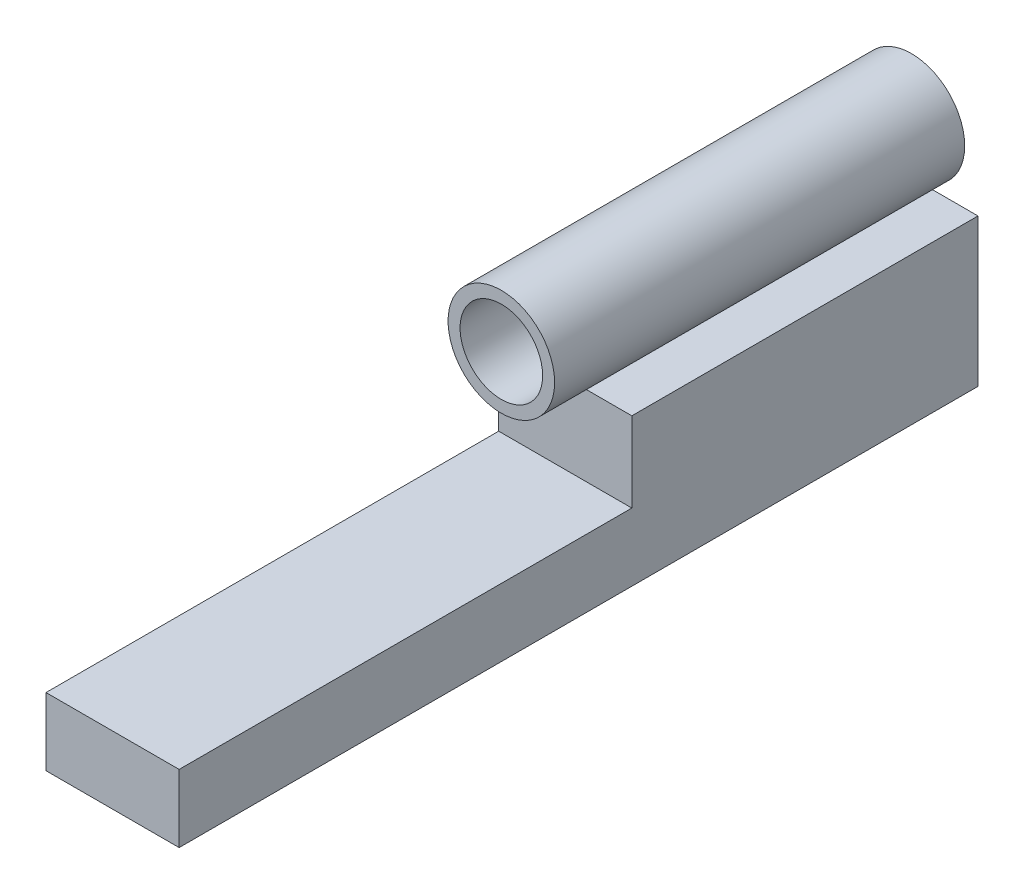
ISO-10303-21;
HEADER;
FILE_DESCRIPTION(('STEP AP214'),'2;1');
FILE_NAME('part.step','',(''),(''),'','','');
FILE_SCHEMA(('AUTOMOTIVE_DESIGN { 1 0 10303 214 1 1 1 1 }'));
ENDSEC;
DATA;
#1=APPLICATION_CONTEXT('core data for automotive mechanical design processes');
#2=APPLICATION_PROTOCOL_DEFINITION('international standard','automotive_design',2000,#1);
#3=PRODUCT_CONTEXT('',#1,'mechanical');
#4=PRODUCT('Part','Part','',(#3));
#5=PRODUCT_RELATED_PRODUCT_CATEGORY('part','',(#4));
#6=PRODUCT_DEFINITION_FORMATION('','',#4);
#7=PRODUCT_DEFINITION_CONTEXT('part definition',#1,'design');
#8=PRODUCT_DEFINITION('design','',#6,#7);
#9=PRODUCT_DEFINITION_SHAPE('','',#8);
#10=(LENGTH_UNIT() NAMED_UNIT(*) SI_UNIT(.MILLI.,.METRE.));
#11=(NAMED_UNIT(*) PLANE_ANGLE_UNIT() SI_UNIT($,.RADIAN.));
#12=(NAMED_UNIT(*) SI_UNIT($,.STERADIAN.) SOLID_ANGLE_UNIT());
#13=UNCERTAINTY_MEASURE_WITH_UNIT(LENGTH_MEASURE(1.E-05),#10,'distance_accuracy_value','');
#14=(GEOMETRIC_REPRESENTATION_CONTEXT(3) GLOBAL_UNCERTAINTY_ASSIGNED_CONTEXT((#13)) GLOBAL_UNIT_ASSIGNED_CONTEXT((#10,
#11,#12)) REPRESENTATION_CONTEXT('',''));
#15=CARTESIAN_POINT('',(0.,0.,0.));
#16=DIRECTION('',(0.,0.,1.));
#17=DIRECTION('',(1.,0.,0.));
#18=AXIS2_PLACEMENT_3D('',#15,#16,#17);
#19=CARTESIAN_POINT('',(12.5,0.,65.));
#20=DIRECTION('',(1.,0.,0.));
#21=DIRECTION('',(0.,1.,0.));
#22=AXIS2_PLACEMENT_3D('',#19,#20,#21);
#23=PLANE('',#22);
#24=DIRECTION('',(0.,-1.,0.));
#25=VECTOR('',#24,1.);
#26=CARTESIAN_POINT('',(12.5,0.,0.));
#27=LINE('',#26,#25);
#28=CARTESIAN_POINT('',(12.5,0.,0.));
#29=VERTEX_POINT('',#28);
#30=CARTESIAN_POINT('',(12.5,-27.7165397130867,0.));
#31=VERTEX_POINT('',#30);
#32=EDGE_CURVE('E94',#29,#31,#27,.T.);
#33=ORIENTED_EDGE('',*,*,#32,.F.);
#34=DIRECTION('',(0.,0.,-1.));
#35=VECTOR('',#34,1.);
#36=CARTESIAN_POINT('',(12.5,0.,65.));
#37=LINE('',#36,#35);
#38=CARTESIAN_POINT('',(12.5,0.,65.));
#39=VERTEX_POINT('',#38);
#40=EDGE_CURVE('E12',#39,#29,#37,.T.);
#41=ORIENTED_EDGE('',*,*,#40,.F.);
#42=DIRECTION('',(0.,-1.,0.));
#43=VECTOR('',#42,1.);
#44=CARTESIAN_POINT('',(12.5,0.,65.));
#45=LINE('',#44,#43);
#46=CARTESIAN_POINT('',(12.5,-15.,65.));
#47=VERTEX_POINT('',#46);
#48=EDGE_CURVE('E91',#39,#47,#45,.T.);
#49=ORIENTED_EDGE('',*,*,#48,.T.);
#50=DIRECTION('',(0.,0.,-1.));
#51=VECTOR('',#50,1.);
#52=CARTESIAN_POINT('',(12.5,-15.,150.));
#53=LINE('',#52,#51);
#54=CARTESIAN_POINT('',(12.5,-15.,150.));
#55=VERTEX_POINT('',#54);
#56=EDGE_CURVE('E63',#55,#47,#53,.T.);
#57=ORIENTED_EDGE('',*,*,#56,.F.);
#58=DIRECTION('',(0.,-1.,0.));
#59=VECTOR('',#58,1.);
#60=CARTESIAN_POINT('',(12.5,0.,150.));
#61=LINE('',#60,#59);
#62=CARTESIAN_POINT('',(12.5,-27.7165397130867,150.));
#63=VERTEX_POINT('',#62);
#64=EDGE_CURVE('E140',#55,#63,#61,.T.);
#65=ORIENTED_EDGE('',*,*,#64,.T.);
#66=DIRECTION('',(0.,0.,-1.));
#67=VECTOR('',#66,1.);
#68=CARTESIAN_POINT('',(12.5,-27.7165397130867,150.));
#69=LINE('',#68,#67);
#70=EDGE_CURVE('E129',#63,#31,#69,.T.);
#71=ORIENTED_EDGE('',*,*,#70,.T.);
#72=EDGE_LOOP('',(#33,#41,#49,#57,#65,#71));
#73=FACE_BOUND('',#72,.T.);
#74=ADVANCED_FACE('F45',(#73),#23,.T.);
#75=CARTESIAN_POINT('',(0.,0.,65.));
#76=DIRECTION('',(0.,1.,0.));
#77=DIRECTION('',(0.,0.,1.));
#78=AXIS2_PLACEMENT_3D('',#75,#76,#77);
#79=PLANE('',#78);
#80=DIRECTION('',(1.,0.,0.));
#81=VECTOR('',#80,1.);
#82=CARTESIAN_POINT('',(0.,0.,0.));
#83=LINE('',#82,#81);
#84=CARTESIAN_POINT('',(-12.5,0.,0.));
#85=VERTEX_POINT('',#84);
#86=EDGE_CURVE('E120',#85,#29,#83,.T.);
#87=ORIENTED_EDGE('',*,*,#86,.F.);
#88=DIRECTION('',(0.,0.,-1.));
#89=VECTOR('',#88,1.);
#90=CARTESIAN_POINT('',(-12.5,0.,65.));
#91=LINE('',#90,#89);
#92=CARTESIAN_POINT('',(-12.5,0.,65.));
#93=VERTEX_POINT('',#92);
#94=EDGE_CURVE('E54',#93,#85,#91,.T.);
#95=ORIENTED_EDGE('',*,*,#94,.F.);
#96=DIRECTION('',(1.,0.,0.));
#97=VECTOR('',#96,1.);
#98=CARTESIAN_POINT('',(0.,0.,65.));
#99=LINE('',#98,#97);
#100=EDGE_CURVE('E100',#93,#39,#99,.T.);
#101=ORIENTED_EDGE('',*,*,#100,.T.);
#102=ORIENTED_EDGE('',*,*,#40,.T.);
#103=EDGE_LOOP('',(#87,#95,#101,#102));
#104=FACE_BOUND('',#103,.T.);
#105=ADVANCED_FACE('F103',(#104),#79,.T.);
#106=CARTESIAN_POINT('',(-12.5,0.,65.));
#107=DIRECTION('',(1.,0.,0.));
#108=DIRECTION('',(0.,1.,0.));
#109=AXIS2_PLACEMENT_3D('',#106,#107,#108);
#110=PLANE('',#109);
#111=DIRECTION('',(0.,-1.,0.));
#112=VECTOR('',#111,1.);
#113=CARTESIAN_POINT('',(-12.5,0.,0.));
#114=LINE('',#113,#112);
#115=CARTESIAN_POINT('',(-12.5,-27.7165397130867,0.));
#116=VERTEX_POINT('',#115);
#117=EDGE_CURVE('E101',#85,#116,#114,.T.);
#118=ORIENTED_EDGE('',*,*,#117,.T.);
#119=DIRECTION('',(0.,0.,-1.));
#120=VECTOR('',#119,1.);
#121=CARTESIAN_POINT('',(-12.5,-27.7165397130867,150.));
#122=LINE('',#121,#120);
#123=CARTESIAN_POINT('',(-12.5,-27.7165397130867,150.));
#124=VERTEX_POINT('',#123);
#125=EDGE_CURVE('E125',#124,#116,#122,.T.);
#126=ORIENTED_EDGE('',*,*,#125,.F.);
#127=DIRECTION('',(0.,-1.,0.));
#128=VECTOR('',#127,1.);
#129=CARTESIAN_POINT('',(-12.5,0.,150.));
#130=LINE('',#129,#128);
#131=CARTESIAN_POINT('',(-12.5,-15.,150.));
#132=VERTEX_POINT('',#131);
#133=EDGE_CURVE('E142',#132,#124,#130,.T.);
#134=ORIENTED_EDGE('',*,*,#133,.F.);
#135=DIRECTION('',(0.,0.,-1.));
#136=VECTOR('',#135,1.);
#137=CARTESIAN_POINT('',(-12.5,-15.,150.));
#138=LINE('',#137,#136);
#139=CARTESIAN_POINT('',(-12.5,-15.,65.));
#140=VERTEX_POINT('',#139);
#141=EDGE_CURVE('E124',#132,#140,#138,.T.);
#142=ORIENTED_EDGE('',*,*,#141,.T.);
#143=DIRECTION('',(0.,-1.,0.));
#144=VECTOR('',#143,1.);
#145=CARTESIAN_POINT('',(-12.5,0.,65.));
#146=LINE('',#145,#144);
#147=EDGE_CURVE('E105',#93,#140,#146,.T.);
#148=ORIENTED_EDGE('',*,*,#147,.F.);
#149=ORIENTED_EDGE('',*,*,#94,.T.);
#150=EDGE_LOOP('',(#118,#126,#134,#142,#148,#149));
#151=FACE_BOUND('',#150,.T.);
#152=ADVANCED_FACE('F160',(#151),#110,.F.);
#153=CARTESIAN_POINT('',(0.,0.,65.));
#154=DIRECTION('',(0.,0.,1.));
#155=DIRECTION('',(1.,0.,0.));
#156=AXIS2_PLACEMENT_3D('',#153,#154,#155);
#157=PLANE('',#156);
#158=ORIENTED_EDGE('',*,*,#48,.F.);
#159=ORIENTED_EDGE('',*,*,#100,.F.);
#160=ORIENTED_EDGE('',*,*,#147,.T.);
#161=DIRECTION('',(1.,0.,0.));
#162=VECTOR('',#161,1.);
#163=CARTESIAN_POINT('',(0.,-15.,65.));
#164=LINE('',#163,#162);
#165=EDGE_CURVE('E80',#140,#47,#164,.T.);
#166=ORIENTED_EDGE('',*,*,#165,.T.);
#167=EDGE_LOOP('',(#158,#159,#160,#166));
#168=FACE_BOUND('',#167,.T.);
#169=ADVANCED_FACE('F98',(#168),#157,.T.);
#170=CARTESIAN_POINT('',(0.,0.,0.));
#171=DIRECTION('',(0.,0.,1.));
#172=DIRECTION('',(1.,0.,0.));
#173=AXIS2_PLACEMENT_3D('',#170,#171,#172);
#174=PLANE('',#173);
#175=ORIENTED_EDGE('',*,*,#32,.T.);
#176=DIRECTION('',(1.,0.,0.));
#177=VECTOR('',#176,1.);
#178=CARTESIAN_POINT('',(0.,-27.7165397130867,0.));
#179=LINE('',#178,#177);
#180=EDGE_CURVE('E137',#116,#31,#179,.T.);
#181=ORIENTED_EDGE('',*,*,#180,.F.);
#182=ORIENTED_EDGE('',*,*,#117,.F.);
#183=ORIENTED_EDGE('',*,*,#86,.T.);
#184=EDGE_LOOP('',(#175,#181,#182,#183));
#185=FACE_BOUND('',#184,.T.);
#186=ADVANCED_FACE('F165',(#185),#174,.F.);
#187=CARTESIAN_POINT('',(0.,-15.,150.));
#188=DIRECTION('',(0.,1.,0.));
#189=DIRECTION('',(-1.,0.,0.));
#190=AXIS2_PLACEMENT_3D('',#187,#188,#189);
#191=PLANE('',#190);
#192=ORIENTED_EDGE('',*,*,#165,.F.);
#193=ORIENTED_EDGE('',*,*,#141,.F.);
#194=DIRECTION('',(1.,0.,0.));
#195=VECTOR('',#194,1.);
#196=CARTESIAN_POINT('',(0.,-15.,150.));
#197=LINE('',#196,#195);
#198=EDGE_CURVE('E145',#132,#55,#197,.T.);
#199=ORIENTED_EDGE('',*,*,#198,.T.);
#200=ORIENTED_EDGE('',*,*,#56,.T.);
#201=EDGE_LOOP('',(#192,#193,#199,#200));
#202=FACE_BOUND('',#201,.T.);
#203=ADVANCED_FACE('F157',(#202),#191,.T.);
#204=CARTESIAN_POINT('',(0.,-27.7165397130867,150.));
#205=DIRECTION('',(0.,1.,0.));
#206=DIRECTION('',(0.,0.,1.));
#207=AXIS2_PLACEMENT_3D('',#204,#205,#206);
#208=PLANE('',#207);
#209=ORIENTED_EDGE('',*,*,#180,.T.);
#210=ORIENTED_EDGE('',*,*,#70,.F.);
#211=DIRECTION('',(1.,0.,0.));
#212=VECTOR('',#211,1.);
#213=CARTESIAN_POINT('',(0.,-27.7165397130867,150.));
#214=LINE('',#213,#212);
#215=EDGE_CURVE('E136',#124,#63,#214,.T.);
#216=ORIENTED_EDGE('',*,*,#215,.F.);
#217=ORIENTED_EDGE('',*,*,#125,.T.);
#218=EDGE_LOOP('',(#209,#210,#216,#217));
#219=FACE_BOUND('',#218,.T.);
#220=ADVANCED_FACE('F164',(#219),#208,.F.);
#221=CARTESIAN_POINT('',(0.,0.,150.));
#222=DIRECTION('',(0.,0.,1.));
#223=DIRECTION('',(1.,0.,0.));
#224=AXIS2_PLACEMENT_3D('',#221,#222,#223);
#225=PLANE('',#224);
#226=ORIENTED_EDGE('',*,*,#64,.F.);
#227=ORIENTED_EDGE('',*,*,#198,.F.);
#228=ORIENTED_EDGE('',*,*,#133,.T.);
#229=ORIENTED_EDGE('',*,*,#215,.T.);
#230=EDGE_LOOP('',(#226,#227,#228,#229));
#231=FACE_BOUND('',#230,.T.);
#232=ADVANCED_FACE('F153',(#231),#225,.T.);
#233=CLOSED_SHELL('',(#74,#105,#152,#169,#186,#203,#220,#232));
#234=MANIFOLD_SOLID_BREP('B2',#233);
#235=CARTESIAN_POINT('',(0.,10.1604272763685,2.5));
#236=DIRECTION('',(0.,0.,-1.));
#237=DIRECTION('',(-1.,0.,0.));
#238=AXIS2_PLACEMENT_3D('',#235,#236,#237);
#239=CYLINDRICAL_SURFACE('',#238,2.5);
#240=CARTESIAN_POINT('',(0.,10.1604272763685,2.5));
#241=DIRECTION('',(0.,0.,1.));
#242=DIRECTION('',(1.,0.,0.));
#243=AXIS2_PLACEMENT_3D('',#240,#241,#242);
#244=CIRCLE('',#243,2.5);
#245=CARTESIAN_POINT('',(2.5,10.1604272763685,2.5));
#246=VERTEX_POINT('',#245);
#247=EDGE_CURVE('E44',#246,#246,#244,.T.);
#248=ORIENTED_EDGE('',*,*,#247,.T.);
#249=EDGE_LOOP('',(#248));
#250=FACE_BOUND('',#249,.T.);
#251=CARTESIAN_POINT('',(0.,10.1604272763685,0.));
#252=DIRECTION('',(0.,0.,1.));
#253=DIRECTION('',(1.,0.,0.));
#254=AXIS2_PLACEMENT_3D('',#251,#252,#253);
#255=CIRCLE('',#254,2.5);
#256=CARTESIAN_POINT('',(2.5,10.1604272763685,0.));
#257=VERTEX_POINT('',#256);
#258=EDGE_CURVE('E246',#257,#257,#255,.T.);
#259=ORIENTED_EDGE('',*,*,#258,.F.);
#260=EDGE_LOOP('',(#259));
#261=FACE_BOUND('',#260,.T.);
#262=ADVANCED_FACE('F243',(#250,#261),#239,.F.);
#263=CARTESIAN_POINT('',(0.,0.,2.5));
#264=DIRECTION('',(0.,0.,1.));
#265=DIRECTION('',(1.,0.,0.));
#266=AXIS2_PLACEMENT_3D('',#263,#264,#265);
#267=PLANE('',#266);
#268=ORIENTED_EDGE('',*,*,#247,.F.);
#269=EDGE_LOOP('',(#268));
#270=FACE_BOUND('',#269,.T.);
#271=CARTESIAN_POINT('',(0.,10.1604272763685,2.5));
#272=DIRECTION('',(0.,0.,1.));
#273=DIRECTION('',(1.,0.,0.));
#274=AXIS2_PLACEMENT_3D('',#271,#272,#273);
#275=CIRCLE('',#274,7.75);
#276=CARTESIAN_POINT('',(7.75,10.1604272763685,2.5));
#277=VERTEX_POINT('',#276);
#278=EDGE_CURVE('E253',#277,#277,#275,.F.);
#279=ORIENTED_EDGE('',*,*,#278,.F.);
#280=EDGE_LOOP('',(#279));
#281=FACE_BOUND('',#280,.T.);
#282=ADVANCED_FACE('F283',(#270,#281),#267,.T.);
#283=CARTESIAN_POINT('',(0.,0.,0.));
#284=DIRECTION('',(0.,0.,1.));
#285=DIRECTION('',(1.,0.,0.));
#286=AXIS2_PLACEMENT_3D('',#283,#284,#285);
#287=PLANE('',#286);
#288=ORIENTED_EDGE('',*,*,#258,.T.);
#289=EDGE_LOOP('',(#288));
#290=FACE_BOUND('',#289,.T.);
#291=CARTESIAN_POINT('',(0.,10.1604272763685,0.));
#292=DIRECTION('',(0.,0.,1.));
#293=DIRECTION('',(1.,0.,0.));
#294=AXIS2_PLACEMENT_3D('',#291,#292,#293);
#295=CIRCLE('',#294,10.);
#296=CARTESIAN_POINT('',(10.,10.1604272763685,0.));
#297=VERTEX_POINT('',#296);
#298=EDGE_CURVE('E258',#297,#297,#295,.T.);
#299=ORIENTED_EDGE('',*,*,#298,.F.);
#300=EDGE_LOOP('',(#299));
#301=FACE_BOUND('',#300,.T.);
#302=ADVANCED_FACE('F281',(#290,#301),#287,.F.);
#303=CARTESIAN_POINT('',(0.,10.1604272763685,77.));
#304=DIRECTION('',(0.,0.,-1.));
#305=DIRECTION('',(-1.,0.,0.));
#306=AXIS2_PLACEMENT_3D('',#303,#304,#305);
#307=CYLINDRICAL_SURFACE('',#306,7.75);
#308=ORIENTED_EDGE('',*,*,#278,.T.);
#309=EDGE_LOOP('',(#308));
#310=FACE_BOUND('',#309,.T.);
#311=CARTESIAN_POINT('',(0.,10.1604272763685,77.));
#312=DIRECTION('',(0.,0.,1.));
#313=DIRECTION('',(1.,0.,0.));
#314=AXIS2_PLACEMENT_3D('',#311,#312,#313);
#315=CIRCLE('',#314,7.75);
#316=CARTESIAN_POINT('',(7.75,10.1604272763685,77.));
#317=VERTEX_POINT('',#316);
#318=EDGE_CURVE('E261',#317,#317,#315,.T.);
#319=ORIENTED_EDGE('',*,*,#318,.T.);
#320=EDGE_LOOP('',(#319));
#321=FACE_BOUND('',#320,.T.);
#322=ADVANCED_FACE('F267',(#310,#321),#307,.F.);
#323=CARTESIAN_POINT('',(0.,10.1604272763685,77.));
#324=DIRECTION('',(0.,0.,-1.));
#325=DIRECTION('',(-1.,0.,0.));
#326=AXIS2_PLACEMENT_3D('',#323,#324,#325);
#327=CYLINDRICAL_SURFACE('',#326,10.);
#328=CARTESIAN_POINT('',(0.,10.1604272763685,77.));
#329=DIRECTION('',(0.,0.,1.));
#330=DIRECTION('',(1.,0.,0.));
#331=AXIS2_PLACEMENT_3D('',#328,#329,#330);
#332=CIRCLE('',#331,10.);
#333=CARTESIAN_POINT('',(10.,10.1604272763685,77.));
#334=VERTEX_POINT('',#333);
#335=EDGE_CURVE('E257',#334,#334,#332,.T.);
#336=ORIENTED_EDGE('',*,*,#335,.F.);
#337=EDGE_LOOP('',(#336));
#338=FACE_BOUND('',#337,.T.);
#339=ORIENTED_EDGE('',*,*,#298,.T.);
#340=EDGE_LOOP('',(#339));
#341=FACE_BOUND('',#340,.T.);
#342=ADVANCED_FACE('F272',(#338,#341),#327,.T.);
#343=CARTESIAN_POINT('',(0.,0.,77.));
#344=DIRECTION('',(0.,0.,1.));
#345=DIRECTION('',(1.,0.,0.));
#346=AXIS2_PLACEMENT_3D('',#343,#344,#345);
#347=PLANE('',#346);
#348=ORIENTED_EDGE('',*,*,#318,.F.);
#349=EDGE_LOOP('',(#348));
#350=FACE_BOUND('',#349,.T.);
#351=ORIENTED_EDGE('',*,*,#335,.T.);
#352=EDGE_LOOP('',(#351));
#353=FACE_BOUND('',#352,.T.);
#354=ADVANCED_FACE('F269',(#350,#353),#347,.T.);
#355=CLOSED_SHELL('',(#262,#282,#302,#322,#342,#354));
#356=MANIFOLD_SOLID_BREP('B6',#355);
#357=ADVANCED_BREP_SHAPE_REPRESENTATION('',(#18,#234,#356),#14);
#358=SHAPE_DEFINITION_REPRESENTATION(#9,#357);
ENDSEC;
END-ISO-10303-21;
